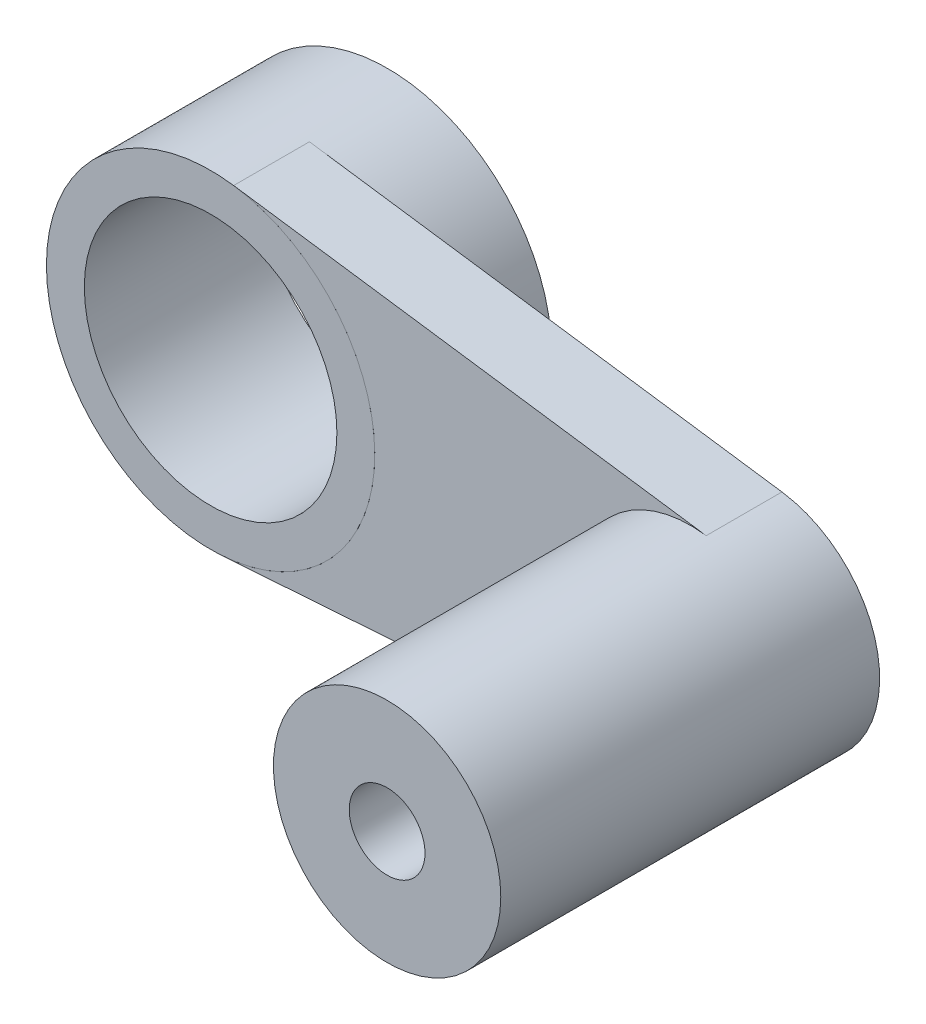
ISO-10303-21;
HEADER;
FILE_DESCRIPTION(('STEP AP214'),'2;1');
FILE_NAME('part.step','',(''),(''),'','','');
FILE_SCHEMA(('AUTOMOTIVE_DESIGN { 1 0 10303 214 1 1 1 1 }'));
ENDSEC;
DATA;
#1=APPLICATION_CONTEXT('core data for automotive mechanical design processes');
#2=APPLICATION_PROTOCOL_DEFINITION('international standard','automotive_design',2000,#1);
#3=PRODUCT_CONTEXT('',#1,'mechanical');
#4=PRODUCT('Part','Part','',(#3));
#5=PRODUCT_RELATED_PRODUCT_CATEGORY('part','',(#4));
#6=PRODUCT_DEFINITION_FORMATION('','',#4);
#7=PRODUCT_DEFINITION_CONTEXT('part definition',#1,'design');
#8=PRODUCT_DEFINITION('design','',#6,#7);
#9=PRODUCT_DEFINITION_SHAPE('','',#8);
#10=(LENGTH_UNIT() NAMED_UNIT(*) SI_UNIT(.MILLI.,.METRE.));
#11=(NAMED_UNIT(*) PLANE_ANGLE_UNIT() SI_UNIT($,.RADIAN.));
#12=(NAMED_UNIT(*) SI_UNIT($,.STERADIAN.) SOLID_ANGLE_UNIT());
#13=UNCERTAINTY_MEASURE_WITH_UNIT(LENGTH_MEASURE(1.E-05),#10,'distance_accuracy_value','');
#14=(GEOMETRIC_REPRESENTATION_CONTEXT(3) GLOBAL_UNCERTAINTY_ASSIGNED_CONTEXT((#13)) GLOBAL_UNIT_ASSIGNED_CONTEXT((#10,
#11,#12)) REPRESENTATION_CONTEXT('',''));
#15=CARTESIAN_POINT('',(0.,0.,0.));
#16=DIRECTION('',(0.,0.,1.));
#17=DIRECTION('',(1.,0.,0.));
#18=AXIS2_PLACEMENT_3D('',#15,#16,#17);
#19=CARTESIAN_POINT('',(0.555704140298588,16.8390492622812,-14.));
#20=DIRECTION('',(0.,0.,1.));
#21=DIRECTION('',(1.,0.,0.));
#22=AXIS2_PLACEMENT_3D('',#19,#20,#21);
#23=CYLINDRICAL_SURFACE('',#22,10.);
#24=CARTESIAN_POINT('',(0.555704140298588,16.8390492622812,-14.));
#25=DIRECTION('',(0.,0.,1.));
#26=DIRECTION('',(1.,0.,0.));
#27=AXIS2_PLACEMENT_3D('',#24,#25,#26);
#28=CIRCLE('',#27,10.);
#29=CARTESIAN_POINT('',(10.5557041402986,16.8390492622812,-14.));
#30=VERTEX_POINT('',#29);
#31=EDGE_CURVE('E60',#30,#30,#28,.T.);
#32=ORIENTED_EDGE('',*,*,#31,.F.);
#33=EDGE_LOOP('',(#32));
#34=FACE_BOUND('',#33,.T.);
#35=CARTESIAN_POINT('',(0.555704140298588,16.8390492622812,0.));
#36=DIRECTION('',(0.,0.,1.));
#37=DIRECTION('',(1.,0.,0.));
#38=AXIS2_PLACEMENT_3D('',#35,#36,#37);
#39=CIRCLE('',#38,10.);
#40=CARTESIAN_POINT('',(10.5557041402986,16.8390492622812,0.));
#41=VERTEX_POINT('',#40);
#42=EDGE_CURVE('E66',#41,#41,#39,.T.);
#43=ORIENTED_EDGE('',*,*,#42,.T.);
#44=EDGE_LOOP('',(#43));
#45=FACE_BOUND('',#44,.T.);
#46=ADVANCED_FACE('F53',(#34,#45),#23,.F.);
#47=CARTESIAN_POINT('',(0.555704140298588,16.8390492622812,-14.));
#48=DIRECTION('',(0.,0.,1.));
#49=DIRECTION('',(1.,0.,0.));
#50=AXIS2_PLACEMENT_3D('',#47,#48,#49);
#51=CYLINDRICAL_SURFACE('',#50,13.);
#52=CARTESIAN_POINT('',(0.555704140298588,16.8390492622812,-14.));
#53=DIRECTION('',(0.,0.,1.));
#54=DIRECTION('',(1.,0.,0.));
#55=AXIS2_PLACEMENT_3D('',#52,#53,#54);
#56=CIRCLE('',#55,13.);
#57=CARTESIAN_POINT('',(13.5557041402986,16.8390492622812,-14.));
#58=VERTEX_POINT('',#57);
#59=EDGE_CURVE('E11',#58,#58,#56,.T.);
#60=ORIENTED_EDGE('',*,*,#59,.T.);
#61=EDGE_LOOP('',(#60));
#62=FACE_BOUND('',#61,.T.);
#63=CARTESIAN_POINT('',(0.555704140298588,16.8390492622812,0.));
#64=DIRECTION('',(0.,0.,1.));
#65=DIRECTION('',(1.,0.,0.));
#66=AXIS2_PLACEMENT_3D('',#63,#64,#65);
#67=CIRCLE('',#66,13.);
#68=CARTESIAN_POINT('',(13.5557041402986,16.8390492622812,0.));
#69=VERTEX_POINT('',#68);
#70=EDGE_CURVE('E56',#69,#69,#67,.T.);
#71=ORIENTED_EDGE('',*,*,#70,.F.);
#72=EDGE_LOOP('',(#71));
#73=FACE_BOUND('',#72,.T.);
#74=ADVANCED_FACE('F75',(#62,#73),#51,.T.);
#75=CARTESIAN_POINT('',(0.,0.,-14.));
#76=DIRECTION('',(0.,0.,1.));
#77=DIRECTION('',(1.,0.,0.));
#78=AXIS2_PLACEMENT_3D('',#75,#76,#77);
#79=PLANE('',#78);
#80=ORIENTED_EDGE('',*,*,#31,.T.);
#81=EDGE_LOOP('',(#80));
#82=FACE_BOUND('',#81,.T.);
#83=ORIENTED_EDGE('',*,*,#59,.F.);
#84=EDGE_LOOP('',(#83));
#85=FACE_BOUND('',#84,.T.);
#86=ADVANCED_FACE('F77',(#82,#85),#79,.F.);
#87=CARTESIAN_POINT('',(0.,0.,0.));
#88=DIRECTION('',(0.,0.,1.));
#89=DIRECTION('',(1.,0.,0.));
#90=AXIS2_PLACEMENT_3D('',#87,#88,#89);
#91=PLANE('',#90);
#92=ORIENTED_EDGE('',*,*,#42,.F.);
#93=EDGE_LOOP('',(#92));
#94=FACE_BOUND('',#93,.T.);
#95=ORIENTED_EDGE('',*,*,#70,.T.);
#96=EDGE_LOOP('',(#95));
#97=FACE_BOUND('',#96,.T.);
#98=ADVANCED_FACE('F73',(#94,#97),#91,.T.);
#99=CLOSED_SHELL('',(#46,#74,#86,#98));
#100=MANIFOLD_SOLID_BREP('B2',#99);
#101=CARTESIAN_POINT('',(38.5318831485404,15.4937508069275,24.));
#102=DIRECTION('',(0.,0.,-1.));
#103=DIRECTION('',(-1.,0.,0.));
#104=AXIS2_PLACEMENT_3D('',#101,#102,#103);
#105=CYLINDRICAL_SURFACE('',#104,9.);
#106=CARTESIAN_POINT('',(38.5318831485404,15.4937508069275,24.));
#107=DIRECTION('',(0.,0.,1.));
#108=DIRECTION('',(1.,0.,0.));
#109=AXIS2_PLACEMENT_3D('',#106,#107,#108);
#110=CIRCLE('',#109,9.);
#111=CARTESIAN_POINT('',(47.5318831485404,15.4937508069275,24.));
#112=VERTEX_POINT('',#111);
#113=EDGE_CURVE('E132',#112,#112,#110,.T.);
#114=ORIENTED_EDGE('',*,*,#113,.F.);
#115=EDGE_LOOP('',(#114));
#116=FACE_BOUND('',#115,.T.);
#117=CARTESIAN_POINT('',(38.5318831485404,15.4937508069275,0.));
#118=DIRECTION('',(0.,0.,1.));
#119=DIRECTION('',(1.,0.,0.));
#120=AXIS2_PLACEMENT_3D('',#117,#118,#119);
#121=CIRCLE('',#120,9.);
#122=CARTESIAN_POINT('',(39.7955108695823,24.4046006531887,0.));
#123=VERTEX_POINT('',#122);
#124=CARTESIAN_POINT('',(39.1618045193221,6.51582236732445,0.));
#125=VERTEX_POINT('',#124);
#126=EDGE_CURVE('E126',#123,#125,#121,.T.);
#127=ORIENTED_EDGE('',*,*,#126,.T.);
#128=DIRECTION('',(0.,0.,1.));
#129=VECTOR('',#128,1.);
#130=CARTESIAN_POINT('',(39.1618045193221,6.51582236732445,-6.));
#131=LINE('',#130,#129);
#132=CARTESIAN_POINT('',(39.1618045193221,6.51582236732445,-6.));
#133=VERTEX_POINT('',#132);
#134=EDGE_CURVE('E169',#133,#125,#131,.T.);
#135=ORIENTED_EDGE('',*,*,#134,.F.);
#136=CARTESIAN_POINT('',(38.5318831485404,15.4937508069275,-6.));
#137=DIRECTION('',(0.,0.,1.));
#138=DIRECTION('',(1.,0.,0.));
#139=AXIS2_PLACEMENT_3D('',#136,#137,#138);
#140=CIRCLE('',#139,9.);
#141=CARTESIAN_POINT('',(39.7955108695823,24.4046006531887,-6.));
#142=VERTEX_POINT('',#141);
#143=EDGE_CURVE('E178',#133,#142,#140,.T.);
#144=ORIENTED_EDGE('',*,*,#143,.T.);
#145=DIRECTION('',(0.,0.,1.));
#146=VECTOR('',#145,1.);
#147=CARTESIAN_POINT('',(39.7955108695823,24.4046006531887,-6.));
#148=LINE('',#147,#146);
#149=EDGE_CURVE('E183',#142,#123,#148,.T.);
#150=ORIENTED_EDGE('',*,*,#149,.T.);
#151=EDGE_LOOP('',(#127,#135,#144,#150));
#152=FACE_BOUND('',#151,.T.);
#153=ADVANCED_FACE('F123',(#116,#152),#105,.T.);
#154=CARTESIAN_POINT('',(38.5318831485404,15.4937508069275,24.));
#155=DIRECTION('',(0.,0.,-1.));
#156=DIRECTION('',(-1.,0.,0.));
#157=AXIS2_PLACEMENT_3D('',#154,#155,#156);
#158=CYLINDRICAL_SURFACE('',#157,3.);
#159=CARTESIAN_POINT('',(38.5318831485404,15.4937508069275,24.));
#160=DIRECTION('',(0.,0.,1.));
#161=DIRECTION('',(1.,0.,0.));
#162=AXIS2_PLACEMENT_3D('',#159,#160,#161);
#163=CIRCLE('',#162,3.);
#164=CARTESIAN_POINT('',(41.5318831485404,15.4937508069275,24.));
#165=VERTEX_POINT('',#164);
#166=EDGE_CURVE('E51',#165,#165,#163,.T.);
#167=ORIENTED_EDGE('',*,*,#166,.T.);
#168=EDGE_LOOP('',(#167));
#169=FACE_BOUND('',#168,.T.);
#170=CARTESIAN_POINT('',(38.5318831485404,15.4937508069275,-6.));
#171=DIRECTION('',(0.,0.,1.));
#172=DIRECTION('',(1.,0.,0.));
#173=AXIS2_PLACEMENT_3D('',#170,#171,#172);
#174=CIRCLE('',#173,3.);
#175=CARTESIAN_POINT('',(41.5318831485404,15.4937508069275,-6.));
#176=VERTEX_POINT('',#175);
#177=EDGE_CURVE('E198',#176,#176,#174,.T.);
#178=ORIENTED_EDGE('',*,*,#177,.F.);
#179=EDGE_LOOP('',(#178));
#180=FACE_BOUND('',#179,.T.);
#181=ADVANCED_FACE('F237',(#169,#180),#158,.F.);
#182=CARTESIAN_POINT('',(0.,0.,24.));
#183=DIRECTION('',(0.,0.,1.));
#184=DIRECTION('',(1.,0.,0.));
#185=AXIS2_PLACEMENT_3D('',#182,#183,#184);
#186=PLANE('',#185);
#187=ORIENTED_EDGE('',*,*,#113,.T.);
#188=EDGE_LOOP('',(#187));
#189=FACE_BOUND('',#188,.T.);
#190=ORIENTED_EDGE('',*,*,#166,.F.);
#191=EDGE_LOOP('',(#190));
#192=FACE_BOUND('',#191,.T.);
#193=ADVANCED_FACE('F232',(#189,#192),#186,.T.);
#194=CARTESIAN_POINT('',(0.,0.,0.));
#195=DIRECTION('',(0.,0.,1.));
#196=DIRECTION('',(1.,0.,0.));
#197=AXIS2_PLACEMENT_3D('',#194,#195,#196);
#198=PLANE('',#197);
#199=ORIENTED_EDGE('',*,*,#126,.F.);
#200=DIRECTION('',(0.990094427362363,-0.140403080115769,0.));
#201=VECTOR('',#200,1.);
#202=CARTESIAN_POINT('',(4.17702974018738,29.4555779351588,0.));
#203=LINE('',#202,#201);
#204=CARTESIAN_POINT('',(2.38094418180359,29.7102768179919,0.));
#205=VERTEX_POINT('',#204);
#206=EDGE_CURVE('E139',#205,#123,#203,.T.);
#207=ORIENTED_EDGE('',*,*,#206,.F.);
#208=CARTESIAN_POINT('',(0.555704140298588,16.8390492622812,0.));
#209=DIRECTION('',(0.,0.,1.));
#210=DIRECTION('',(1.,0.,0.));
#211=AXIS2_PLACEMENT_3D('',#208,#209,#210);
#212=CIRCLE('',#211,13.);
#213=CARTESIAN_POINT('',(1.46559056476114,3.87093040507689,0.));
#214=VERTEX_POINT('',#213);
#215=EDGE_CURVE('E193',#214,#205,#212,.T.);
#216=ORIENTED_EDGE('',*,*,#215,.F.);
#217=DIRECTION('',(0.997547604400334,0.0699912634201962,0.));
#218=VECTOR('',#217,1.);
#219=CARTESIAN_POINT('',(-0.263087277627009,3.74964060827769,0.));
#220=LINE('',#219,#218);
#221=EDGE_CURVE('E202',#214,#125,#220,.T.);
#222=ORIENTED_EDGE('',*,*,#221,.T.);
#223=EDGE_LOOP('',(#199,#207,#216,#222));
#224=FACE_BOUND('',#223,.T.);
#225=ADVANCED_FACE('F222',(#224),#198,.T.);
#226=CARTESIAN_POINT('',(-0.263087277627009,3.74964060827769,-6.));
#227=DIRECTION('',(0.0699912634201962,-0.997547604400334,0.));
#228=DIRECTION('',(0.997547604400334,0.0699912634201962,0.));
#229=AXIS2_PLACEMENT_3D('',#226,#227,#228);
#230=PLANE('',#229);
#231=ORIENTED_EDGE('',*,*,#221,.F.);
#232=DIRECTION('',(0.,0.,1.));
#233=VECTOR('',#232,1.);
#234=CARTESIAN_POINT('',(1.46559056476114,3.87093040507689,-6.));
#235=LINE('',#234,#233);
#236=CARTESIAN_POINT('',(1.46559056476114,3.87093040507689,-6.));
#237=VERTEX_POINT('',#236);
#238=EDGE_CURVE('E148',#237,#214,#235,.T.);
#239=ORIENTED_EDGE('',*,*,#238,.F.);
#240=DIRECTION('',(0.997547604400334,0.0699912634201962,0.));
#241=VECTOR('',#240,1.);
#242=CARTESIAN_POINT('',(-0.263087277627009,3.74964060827769,-6.));
#243=LINE('',#242,#241);
#244=EDGE_CURVE('E190',#237,#133,#243,.T.);
#245=ORIENTED_EDGE('',*,*,#244,.T.);
#246=ORIENTED_EDGE('',*,*,#134,.T.);
#247=EDGE_LOOP('',(#231,#239,#245,#246));
#248=FACE_BOUND('',#247,.T.);
#249=ADVANCED_FACE('F223',(#248),#230,.T.);
#250=CARTESIAN_POINT('',(0.555704140298588,16.8390492622812,-6.));
#251=DIRECTION('',(0.,0.,1.));
#252=DIRECTION('',(1.,0.,0.));
#253=AXIS2_PLACEMENT_3D('',#250,#251,#252);
#254=CYLINDRICAL_SURFACE('',#253,13.);
#255=ORIENTED_EDGE('',*,*,#215,.T.);
#256=DIRECTION('',(0.,0.,1.));
#257=VECTOR('',#256,1.);
#258=CARTESIAN_POINT('',(2.38094418180359,29.7102768179919,-6.));
#259=LINE('',#258,#257);
#260=CARTESIAN_POINT('',(2.38094418180359,29.7102768179919,-6.));
#261=VERTEX_POINT('',#260);
#262=EDGE_CURVE('E187',#261,#205,#259,.T.);
#263=ORIENTED_EDGE('',*,*,#262,.F.);
#264=CARTESIAN_POINT('',(0.555704140298588,16.8390492622812,-6.));
#265=DIRECTION('',(0.,0.,1.));
#266=DIRECTION('',(1.,0.,0.));
#267=AXIS2_PLACEMENT_3D('',#264,#265,#266);
#268=CIRCLE('',#267,13.);
#269=EDGE_CURVE('E179',#237,#261,#268,.T.);
#270=ORIENTED_EDGE('',*,*,#269,.F.);
#271=ORIENTED_EDGE('',*,*,#238,.T.);
#272=EDGE_LOOP('',(#255,#263,#270,#271));
#273=FACE_BOUND('',#272,.T.);
#274=ADVANCED_FACE('F225',(#273),#254,.F.);
#275=CARTESIAN_POINT('',(4.17702974018738,29.4555779351588,-6.));
#276=DIRECTION('',(-0.140403080115769,-0.990094427362363,0.));
#277=DIRECTION('',(0.990094427362363,-0.140403080115769,0.));
#278=AXIS2_PLACEMENT_3D('',#275,#276,#277);
#279=PLANE('',#278);
#280=ORIENTED_EDGE('',*,*,#206,.T.);
#281=ORIENTED_EDGE('',*,*,#149,.F.);
#282=DIRECTION('',(0.990094427362363,-0.140403080115769,0.));
#283=VECTOR('',#282,1.);
#284=CARTESIAN_POINT('',(4.17702974018738,29.4555779351588,-6.));
#285=LINE('',#284,#283);
#286=EDGE_CURVE('E174',#261,#142,#285,.T.);
#287=ORIENTED_EDGE('',*,*,#286,.F.);
#288=ORIENTED_EDGE('',*,*,#262,.T.);
#289=EDGE_LOOP('',(#280,#281,#287,#288));
#290=FACE_BOUND('',#289,.T.);
#291=ADVANCED_FACE('F184',(#290),#279,.F.);
#292=CARTESIAN_POINT('',(0.,0.,-6.));
#293=DIRECTION('',(0.,0.,1.));
#294=DIRECTION('',(1.,0.,0.));
#295=AXIS2_PLACEMENT_3D('',#292,#293,#294);
#296=PLANE('',#295);
#297=ORIENTED_EDGE('',*,*,#244,.F.);
#298=ORIENTED_EDGE('',*,*,#269,.T.);
#299=ORIENTED_EDGE('',*,*,#286,.T.);
#300=ORIENTED_EDGE('',*,*,#143,.F.);
#301=EDGE_LOOP('',(#297,#298,#299,#300));
#302=FACE_BOUND('',#301,.T.);
#303=ORIENTED_EDGE('',*,*,#177,.T.);
#304=EDGE_LOOP('',(#303));
#305=FACE_BOUND('',#304,.T.);
#306=ADVANCED_FACE('F176',(#302,#305),#296,.F.);
#307=CLOSED_SHELL('',(#153,#181,#193,#225,#249,#274,#291,#306));
#308=MANIFOLD_SOLID_BREP('B6',#307);
#309=ADVANCED_BREP_SHAPE_REPRESENTATION('',(#18,#100,#308),#14);
#310=SHAPE_DEFINITION_REPRESENTATION(#9,#309);
ENDSEC;
END-ISO-10303-21;
